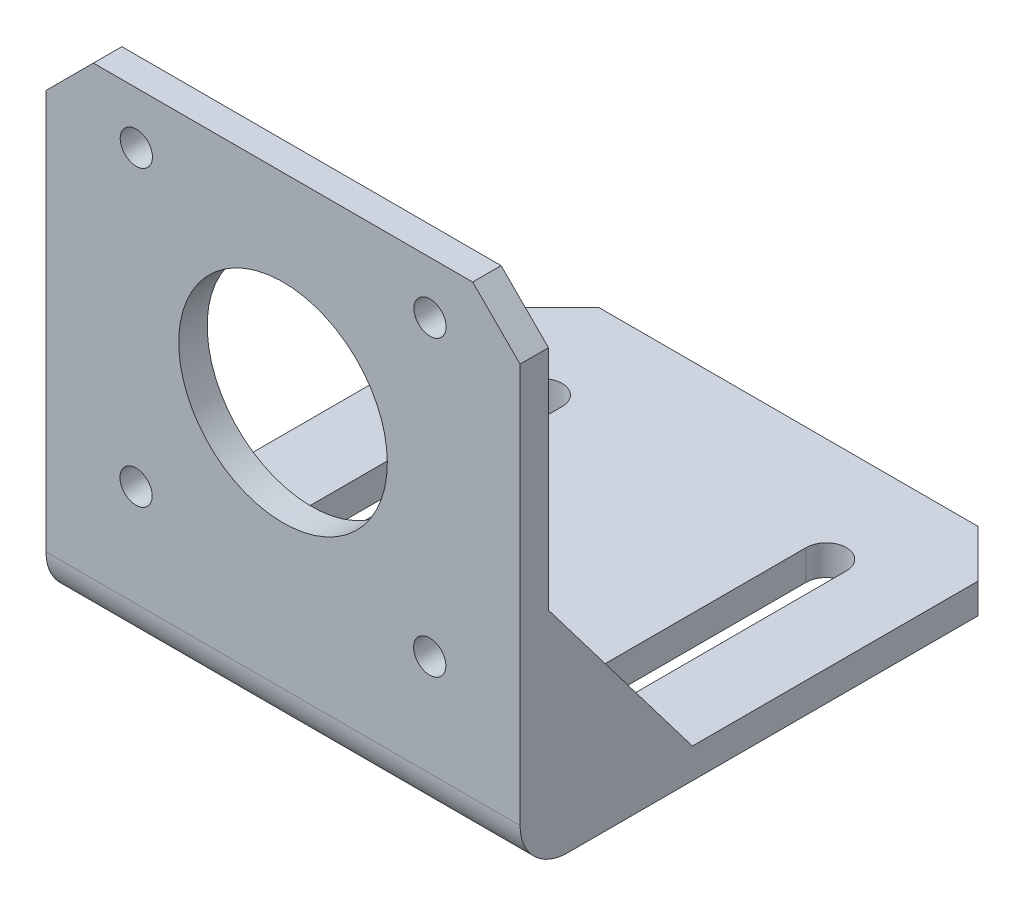
ISO-10303-21;
HEADER;
FILE_DESCRIPTION(('STEP AP214'),'2;1');
FILE_NAME('part.step','',(''),(''),'','','');
FILE_SCHEMA(('AUTOMOTIVE_DESIGN { 1 0 10303 214 1 1 1 1 }'));
ENDSEC;
DATA;
#1=APPLICATION_CONTEXT('core data for automotive mechanical design processes');
#2=APPLICATION_PROTOCOL_DEFINITION('international standard','automotive_design',2000,#1);
#3=PRODUCT_CONTEXT('',#1,'mechanical');
#4=PRODUCT('Part','Part','',(#3));
#5=PRODUCT_RELATED_PRODUCT_CATEGORY('part','',(#4));
#6=PRODUCT_DEFINITION_FORMATION('','',#4);
#7=PRODUCT_DEFINITION_CONTEXT('part definition',#1,'design');
#8=PRODUCT_DEFINITION('design','',#6,#7);
#9=PRODUCT_DEFINITION_SHAPE('','',#8);
#10=(LENGTH_UNIT() NAMED_UNIT(*) SI_UNIT(.MILLI.,.METRE.));
#11=(NAMED_UNIT(*) PLANE_ANGLE_UNIT() SI_UNIT($,.RADIAN.));
#12=(NAMED_UNIT(*) SI_UNIT($,.STERADIAN.) SOLID_ANGLE_UNIT());
#13=UNCERTAINTY_MEASURE_WITH_UNIT(LENGTH_MEASURE(1.E-05),#10,'distance_accuracy_value','');
#14=(GEOMETRIC_REPRESENTATION_CONTEXT(3) GLOBAL_UNCERTAINTY_ASSIGNED_CONTEXT((#13)) GLOBAL_UNIT_ASSIGNED_CONTEXT((#10,
#11,#12)) REPRESENTATION_CONTEXT('',''));
#15=CARTESIAN_POINT('',(0.,0.,0.));
#16=DIRECTION('',(0.,0.,1.));
#17=DIRECTION('',(1.,0.,0.));
#18=AXIS2_PLACEMENT_3D('',#15,#16,#17);
#19=CARTESIAN_POINT('',(0.,3.175,0.));
#20=DIRECTION('',(0.,-1.,0.));
#21=DIRECTION('',(0.,0.,-1.));
#22=AXIS2_PLACEMENT_3D('',#19,#20,#21);
#23=PLANE('',#22);
#24=DIRECTION('',(0.,0.,-1.));
#25=VECTOR('',#24,1.);
#26=CARTESIAN_POINT('',(3.175,3.175,-3.));
#27=LINE('',#26,#25);
#28=CARTESIAN_POINT('',(3.175,3.175,-8.));
#29=VERTEX_POINT('',#28);
#30=CARTESIAN_POINT('',(3.175,3.175,-18.));
#31=VERTEX_POINT('',#30);
#32=EDGE_CURVE('E307',#29,#31,#27,.T.);
#33=ORIENTED_EDGE('',*,*,#32,.F.);
#34=DIRECTION('',(-1.,0.,0.));
#35=VECTOR('',#34,1.);
#36=CARTESIAN_POINT('',(46.825,3.175,-8.));
#37=LINE('',#36,#35);
#38=CARTESIAN_POINT('',(46.825,3.175,-8.));
#39=VERTEX_POINT('',#38);
#40=EDGE_CURVE('E462',#29,#39,#37,.F.);
#41=ORIENTED_EDGE('',*,*,#40,.T.);
#42=DIRECTION('',(0.,0.,1.));
#43=VECTOR('',#42,1.);
#44=CARTESIAN_POINT('',(46.825,3.175,-3.));
#45=LINE('',#44,#43);
#46=CARTESIAN_POINT('',(46.825,3.175,-18.175));
#47=VERTEX_POINT('',#46);
#48=EDGE_CURVE('E301',#47,#39,#45,.T.);
#49=ORIENTED_EDGE('',*,*,#48,.F.);
#50=DIRECTION('',(-1.,0.,0.));
#51=VECTOR('',#50,1.);
#52=CARTESIAN_POINT('',(50.,3.175,-18.175));
#53=LINE('',#52,#51);
#54=CARTESIAN_POINT('',(50.,3.175,-18.175));
#55=VERTEX_POINT('',#54);
#56=EDGE_CURVE('E296',#55,#47,#53,.T.);
#57=ORIENTED_EDGE('',*,*,#56,.F.);
#58=DIRECTION('',(0.,0.,-1.));
#59=VECTOR('',#58,1.);
#60=CARTESIAN_POINT('',(50.,3.175,0.));
#61=LINE('',#60,#59);
#62=CARTESIAN_POINT('',(50.,3.175,-48.3));
#63=VERTEX_POINT('',#62);
#64=EDGE_CURVE('E338',#55,#63,#61,.T.);
#65=ORIENTED_EDGE('',*,*,#64,.T.);
#66=DIRECTION('',(0.707106781186546,0.,0.707106781186549));
#67=VECTOR('',#66,1.);
#68=CARTESIAN_POINT('',(45.,3.175,-53.3));
#69=LINE('',#68,#67);
#70=CARTESIAN_POINT('',(45.,3.175,-53.3));
#71=VERTEX_POINT('',#70);
#72=EDGE_CURVE('E358',#63,#71,#69,.F.);
#73=ORIENTED_EDGE('',*,*,#72,.T.);
#74=DIRECTION('',(-1.,0.,0.));
#75=VECTOR('',#74,1.);
#76=CARTESIAN_POINT('',(0.,3.175,-53.3));
#77=LINE('',#76,#75);
#78=CARTESIAN_POINT('',(5.00000000000002,3.175,-53.3));
#79=VERTEX_POINT('',#78);
#80=EDGE_CURVE('E374',#71,#79,#77,.T.);
#81=ORIENTED_EDGE('',*,*,#80,.T.);
#82=DIRECTION('',(0.70710678118655,0.,-0.707106781186546));
#83=VECTOR('',#82,1.);
#84=CARTESIAN_POINT('',(0.,3.175,-48.3));
#85=LINE('',#84,#83);
#86=CARTESIAN_POINT('',(0.,3.175,-48.3));
#87=VERTEX_POINT('',#86);
#88=EDGE_CURVE('E360',#79,#87,#85,.F.);
#89=ORIENTED_EDGE('',*,*,#88,.T.);
#90=DIRECTION('',(0.,0.,1.));
#91=VECTOR('',#90,1.);
#92=CARTESIAN_POINT('',(0.,3.175,0.));
#93=LINE('',#92,#91);
#94=CARTESIAN_POINT('',(0.,3.175,-18.));
#95=VERTEX_POINT('',#94);
#96=EDGE_CURVE('E335',#87,#95,#93,.T.);
#97=ORIENTED_EDGE('',*,*,#96,.T.);
#98=DIRECTION('',(-1.,0.,0.));
#99=VECTOR('',#98,1.);
#100=CARTESIAN_POINT('',(0.,3.175,-18.));
#101=LINE('',#100,#99);
#102=EDGE_CURVE('E311',#31,#95,#101,.T.);
#103=ORIENTED_EDGE('',*,*,#102,.F.);
#104=EDGE_LOOP('',(#33,#41,#49,#57,#65,#73,#81,#89,#97,#103));
#105=FACE_BOUND('',#104,.T.);
#106=CARTESIAN_POINT('',(10.,3.175,-12.3));
#107=DIRECTION('',(0.,1.,0.));
#108=DIRECTION('',(0.,0.,1.));
#109=AXIS2_PLACEMENT_3D('',#106,#107,#108);
#110=CIRCLE('',#109,2.125);
#111=CARTESIAN_POINT('',(7.87500000000001,3.175,-12.3));
#112=VERTEX_POINT('',#111);
#113=CARTESIAN_POINT('',(12.125,3.175,-12.3));
#114=VERTEX_POINT('',#113);
#115=EDGE_CURVE('E234',#112,#114,#110,.T.);
#116=ORIENTED_EDGE('',*,*,#115,.F.);
#117=DIRECTION('',(0.,0.,1.));
#118=VECTOR('',#117,1.);
#119=CARTESIAN_POINT('',(7.87500000000001,3.175,0.));
#120=LINE('',#119,#118);
#121=CARTESIAN_POINT('',(7.875,3.175,-42.3));
#122=VERTEX_POINT('',#121);
#123=EDGE_CURVE('E230',#122,#112,#120,.T.);
#124=ORIENTED_EDGE('',*,*,#123,.F.);
#125=CARTESIAN_POINT('',(10.,3.175,-42.3));
#126=DIRECTION('',(0.,1.,0.));
#127=DIRECTION('',(0.,0.,1.));
#128=AXIS2_PLACEMENT_3D('',#125,#126,#127);
#129=CIRCLE('',#128,2.125);
#130=CARTESIAN_POINT('',(12.125,3.175,-42.3));
#131=VERTEX_POINT('',#130);
#132=EDGE_CURVE('E240',#131,#122,#129,.T.);
#133=ORIENTED_EDGE('',*,*,#132,.F.);
#134=DIRECTION('',(0.,0.,1.));
#135=VECTOR('',#134,1.);
#136=CARTESIAN_POINT('',(12.125,3.175,0.));
#137=LINE('',#136,#135);
#138=EDGE_CURVE('E237',#131,#114,#137,.T.);
#139=ORIENTED_EDGE('',*,*,#138,.T.);
#140=EDGE_LOOP('',(#116,#124,#133,#139));
#141=FACE_BOUND('',#140,.T.);
#142=DIRECTION('',(0.,0.,1.));
#143=VECTOR('',#142,1.);
#144=CARTESIAN_POINT('',(42.125,3.175,0.));
#145=LINE('',#144,#143);
#146=CARTESIAN_POINT('',(42.125,3.175,-42.3));
#147=VERTEX_POINT('',#146);
#148=CARTESIAN_POINT('',(42.125,3.175,-12.3));
#149=VERTEX_POINT('',#148);
#150=EDGE_CURVE('E220',#147,#149,#145,.T.);
#151=ORIENTED_EDGE('',*,*,#150,.T.);
#152=CARTESIAN_POINT('',(40.,3.175,-12.3));
#153=DIRECTION('',(0.,1.,0.));
#154=DIRECTION('',(0.,0.,1.));
#155=AXIS2_PLACEMENT_3D('',#152,#153,#154);
#156=CIRCLE('',#155,2.12500000000001);
#157=CARTESIAN_POINT('',(37.875,3.175,-12.3));
#158=VERTEX_POINT('',#157);
#159=EDGE_CURVE('E223',#158,#149,#156,.T.);
#160=ORIENTED_EDGE('',*,*,#159,.F.);
#161=DIRECTION('',(0.,0.,1.));
#162=VECTOR('',#161,1.);
#163=CARTESIAN_POINT('',(37.875,3.175,0.));
#164=LINE('',#163,#162);
#165=CARTESIAN_POINT('',(37.875,3.175,-42.3));
#166=VERTEX_POINT('',#165);
#167=EDGE_CURVE('E204',#166,#158,#164,.T.);
#168=ORIENTED_EDGE('',*,*,#167,.F.);
#169=CARTESIAN_POINT('',(40.,3.175,-42.3));
#170=DIRECTION('',(0.,1.,0.));
#171=DIRECTION('',(0.,0.,1.));
#172=AXIS2_PLACEMENT_3D('',#169,#170,#171);
#173=CIRCLE('',#172,2.12500000000001);
#174=EDGE_CURVE('E215',#147,#166,#173,.T.);
#175=ORIENTED_EDGE('',*,*,#174,.F.);
#176=EDGE_LOOP('',(#151,#160,#168,#175));
#177=FACE_BOUND('',#176,.T.);
#178=ADVANCED_FACE('F33',(#105,#141,#177),#23,.F.);
#179=CARTESIAN_POINT('',(0.,0.,0.));
#180=DIRECTION('',(0.,-1.,0.));
#181=DIRECTION('',(0.,0.,-1.));
#182=AXIS2_PLACEMENT_3D('',#179,#180,#181);
#183=PLANE('',#182);
#184=DIRECTION('',(0.,0.,-1.));
#185=VECTOR('',#184,1.);
#186=CARTESIAN_POINT('',(50.,0.,0.));
#187=LINE('',#186,#185);
#188=CARTESIAN_POINT('',(50.,0.,-5.));
#189=VERTEX_POINT('',#188);
#190=CARTESIAN_POINT('',(50.,0.,-48.3));
#191=VERTEX_POINT('',#190);
#192=EDGE_CURVE('E518',#189,#191,#187,.T.);
#193=ORIENTED_EDGE('',*,*,#192,.F.);
#194=DIRECTION('',(1.,0.,0.));
#195=VECTOR('',#194,1.);
#196=CARTESIAN_POINT('',(0.,0.,-5.));
#197=LINE('',#196,#195);
#198=CARTESIAN_POINT('',(0.,0.,-5.));
#199=VERTEX_POINT('',#198);
#200=EDGE_CURVE('E41',#189,#199,#197,.F.);
#201=ORIENTED_EDGE('',*,*,#200,.T.);
#202=DIRECTION('',(0.,0.,1.));
#203=VECTOR('',#202,1.);
#204=CARTESIAN_POINT('',(0.,0.,0.));
#205=LINE('',#204,#203);
#206=CARTESIAN_POINT('',(0.,0.,-48.3));
#207=VERTEX_POINT('',#206);
#208=EDGE_CURVE('E366',#207,#199,#205,.T.);
#209=ORIENTED_EDGE('',*,*,#208,.F.);
#210=DIRECTION('',(-0.70710678118655,0.,0.707106781186546));
#211=VECTOR('',#210,1.);
#212=CARTESIAN_POINT('',(-24.15,0.,-24.1500000000001));
#213=LINE('',#212,#211);
#214=CARTESIAN_POINT('',(5.00000000000002,0.,-53.3));
#215=VERTEX_POINT('',#214);
#216=EDGE_CURVE('E351',#207,#215,#213,.F.);
#217=ORIENTED_EDGE('',*,*,#216,.T.);
#218=DIRECTION('',(-1.,0.,0.));
#219=VECTOR('',#218,1.);
#220=CARTESIAN_POINT('',(0.,0.,-53.3));
#221=LINE('',#220,#219);
#222=CARTESIAN_POINT('',(45.,0.,-53.3));
#223=VERTEX_POINT('',#222);
#224=EDGE_CURVE('E339',#223,#215,#221,.T.);
#225=ORIENTED_EDGE('',*,*,#224,.F.);
#226=DIRECTION('',(-0.707106781186546,0.,-0.707106781186549));
#227=VECTOR('',#226,1.);
#228=CARTESIAN_POINT('',(49.1500000000001,0.,-49.1499999999999));
#229=LINE('',#228,#227);
#230=EDGE_CURVE('E348',#223,#191,#229,.F.);
#231=ORIENTED_EDGE('',*,*,#230,.T.);
#232=EDGE_LOOP('',(#193,#201,#209,#217,#225,#231));
#233=FACE_BOUND('',#232,.T.);
#234=DIRECTION('',(0.,0.,-1.));
#235=VECTOR('',#234,1.);
#236=CARTESIAN_POINT('',(7.87500000000001,0.,0.));
#237=LINE('',#236,#235);
#238=CARTESIAN_POINT('',(7.87500000000001,0.,-12.3));
#239=VERTEX_POINT('',#238);
#240=CARTESIAN_POINT('',(7.875,0.,-42.3));
#241=VERTEX_POINT('',#240);
#242=EDGE_CURVE('E383',#239,#241,#237,.T.);
#243=ORIENTED_EDGE('',*,*,#242,.F.);
#244=CARTESIAN_POINT('',(10.,0.,-12.3));
#245=DIRECTION('',(0.,-1.,0.));
#246=DIRECTION('',(0.,0.,-1.));
#247=AXIS2_PLACEMENT_3D('',#244,#245,#246);
#248=CIRCLE('',#247,2.125);
#249=CARTESIAN_POINT('',(12.125,0.,-12.3));
#250=VERTEX_POINT('',#249);
#251=EDGE_CURVE('E375',#250,#239,#248,.T.);
#252=ORIENTED_EDGE('',*,*,#251,.F.);
#253=DIRECTION('',(0.,0.,-1.));
#254=VECTOR('',#253,1.);
#255=CARTESIAN_POINT('',(12.125,0.,0.));
#256=LINE('',#255,#254);
#257=CARTESIAN_POINT('',(12.125,0.,-42.3));
#258=VERTEX_POINT('',#257);
#259=EDGE_CURVE('E377',#250,#258,#256,.T.);
#260=ORIENTED_EDGE('',*,*,#259,.T.);
#261=CARTESIAN_POINT('',(10.,0.,-42.3));
#262=DIRECTION('',(0.,-1.,0.));
#263=DIRECTION('',(0.,0.,-1.));
#264=AXIS2_PLACEMENT_3D('',#261,#262,#263);
#265=CIRCLE('',#264,2.125);
#266=EDGE_CURVE('E381',#241,#258,#265,.T.);
#267=ORIENTED_EDGE('',*,*,#266,.F.);
#268=EDGE_LOOP('',(#243,#252,#260,#267));
#269=FACE_BOUND('',#268,.T.);
#270=CARTESIAN_POINT('',(40.,0.,-12.3));
#271=DIRECTION('',(0.,-1.,0.));
#272=DIRECTION('',(0.,0.,-1.));
#273=AXIS2_PLACEMENT_3D('',#270,#271,#272);
#274=CIRCLE('',#273,2.12500000000001);
#275=CARTESIAN_POINT('',(42.125,0.,-12.3));
#276=VERTEX_POINT('',#275);
#277=CARTESIAN_POINT('',(37.875,0.,-12.3));
#278=VERTEX_POINT('',#277);
#279=EDGE_CURVE('E388',#276,#278,#274,.T.);
#280=ORIENTED_EDGE('',*,*,#279,.F.);
#281=DIRECTION('',(0.,0.,-1.));
#282=VECTOR('',#281,1.);
#283=CARTESIAN_POINT('',(42.125,0.,0.));
#284=LINE('',#283,#282);
#285=CARTESIAN_POINT('',(42.125,0.,-42.3));
#286=VERTEX_POINT('',#285);
#287=EDGE_CURVE('E345',#276,#286,#284,.T.);
#288=ORIENTED_EDGE('',*,*,#287,.T.);
#289=CARTESIAN_POINT('',(40.,0.,-42.3));
#290=DIRECTION('',(0.,-1.,0.));
#291=DIRECTION('',(0.,0.,-1.));
#292=AXIS2_PLACEMENT_3D('',#289,#290,#291);
#293=CIRCLE('',#292,2.12500000000001);
#294=CARTESIAN_POINT('',(37.875,0.,-42.3));
#295=VERTEX_POINT('',#294);
#296=EDGE_CURVE('E385',#295,#286,#293,.T.);
#297=ORIENTED_EDGE('',*,*,#296,.F.);
#298=DIRECTION('',(0.,0.,-1.));
#299=VECTOR('',#298,1.);
#300=CARTESIAN_POINT('',(37.875,0.,0.));
#301=LINE('',#300,#299);
#302=EDGE_CURVE('E207',#278,#295,#301,.T.);
#303=ORIENTED_EDGE('',*,*,#302,.F.);
#304=EDGE_LOOP('',(#280,#288,#297,#303));
#305=FACE_BOUND('',#304,.T.);
#306=ADVANCED_FACE('F392',(#233,#269,#305),#183,.T.);
#307=CARTESIAN_POINT('',(0.,52.145,-3.));
#308=DIRECTION('',(0.,0.,1.));
#309=DIRECTION('',(1.,0.,0.));
#310=AXIS2_PLACEMENT_3D('',#307,#308,#309);
#311=PLANE('',#310);
#312=CARTESIAN_POINT('',(40.4720000000004,15.673,-3.));
#313=DIRECTION('',(0.,0.,1.));
#314=DIRECTION('',(1.,0.,0.));
#315=AXIS2_PLACEMENT_3D('',#312,#313,#314);
#316=CIRCLE('',#315,1.7);
#317=CARTESIAN_POINT('',(42.1720000000004,15.673,-3.));
#318=VERTEX_POINT('',#317);
#319=EDGE_CURVE('E255',#318,#318,#316,.T.);
#320=ORIENTED_EDGE('',*,*,#319,.T.);
#321=EDGE_LOOP('',(#320));
#322=FACE_BOUND('',#321,.T.);
#323=CARTESIAN_POINT('',(9.49800000000044,15.7029999999996,-3.));
#324=DIRECTION('',(0.,0.,1.));
#325=DIRECTION('',(1.,0.,0.));
#326=AXIS2_PLACEMENT_3D('',#323,#324,#325);
#327=CIRCLE('',#326,1.7);
#328=CARTESIAN_POINT('',(11.1980000000004,15.7029999999996,-3.));
#329=VERTEX_POINT('',#328);
#330=EDGE_CURVE('E261',#329,#329,#327,.T.);
#331=ORIENTED_EDGE('',*,*,#330,.T.);
#332=EDGE_LOOP('',(#331));
#333=FACE_BOUND('',#332,.T.);
#334=CARTESIAN_POINT('',(9.52800000000001,46.6769999999996,-3.));
#335=DIRECTION('',(0.,0.,1.));
#336=DIRECTION('',(1.,0.,0.));
#337=AXIS2_PLACEMENT_3D('',#334,#335,#336);
#338=CIRCLE('',#337,1.7);
#339=CARTESIAN_POINT('',(11.228,46.6769999999996,-3.));
#340=VERTEX_POINT('',#339);
#341=EDGE_CURVE('E267',#340,#340,#338,.T.);
#342=ORIENTED_EDGE('',*,*,#341,.T.);
#343=EDGE_LOOP('',(#342));
#344=FACE_BOUND('',#343,.T.);
#345=CARTESIAN_POINT('',(40.502,46.647,-3.));
#346=DIRECTION('',(0.,0.,1.));
#347=DIRECTION('',(1.,0.,0.));
#348=AXIS2_PLACEMENT_3D('',#345,#346,#347);
#349=CIRCLE('',#348,1.7);
#350=CARTESIAN_POINT('',(42.202,46.647,-3.));
#351=VERTEX_POINT('',#350);
#352=EDGE_CURVE('E273',#351,#351,#349,.T.);
#353=ORIENTED_EDGE('',*,*,#352,.T.);
#354=EDGE_LOOP('',(#353));
#355=FACE_BOUND('',#354,.T.);
#356=CARTESIAN_POINT('',(25.,31.145,-3.));
#357=DIRECTION('',(0.,0.,1.));
#358=DIRECTION('',(1.,0.,0.));
#359=AXIS2_PLACEMENT_3D('',#356,#357,#358);
#360=CIRCLE('',#359,11.);
#361=CARTESIAN_POINT('',(36.,31.145,-3.));
#362=VERTEX_POINT('',#361);
#363=EDGE_CURVE('E279',#362,#362,#360,.T.);
#364=ORIENTED_EDGE('',*,*,#363,.T.);
#365=EDGE_LOOP('',(#364));
#366=FACE_BOUND('',#365,.T.);
#367=DIRECTION('',(0.,-1.,0.));
#368=VECTOR('',#367,1.);
#369=CARTESIAN_POINT('',(46.825,23.175,-3.));
#370=LINE('',#369,#368);
#371=CARTESIAN_POINT('',(46.825,23.175,-3.));
#372=VERTEX_POINT('',#371);
#373=CARTESIAN_POINT('',(46.825,8.175,-3.));
#374=VERTEX_POINT('',#373);
#375=EDGE_CURVE('E300',#372,#374,#370,.T.);
#376=ORIENTED_EDGE('',*,*,#375,.T.);
#377=DIRECTION('',(-1.,0.,0.));
#378=VECTOR('',#377,1.);
#379=CARTESIAN_POINT('',(3.175,8.175,-3.));
#380=LINE('',#379,#378);
#381=CARTESIAN_POINT('',(3.175,8.175,-3.));
#382=VERTEX_POINT('',#381);
#383=EDGE_CURVE('E464',#374,#382,#380,.T.);
#384=ORIENTED_EDGE('',*,*,#383,.T.);
#385=DIRECTION('',(0.,-1.,0.));
#386=VECTOR('',#385,1.);
#387=CARTESIAN_POINT('',(3.175,23.175,-3.));
#388=LINE('',#387,#386);
#389=CARTESIAN_POINT('',(3.175,23.175,-3.));
#390=VERTEX_POINT('',#389);
#391=EDGE_CURVE('E320',#390,#382,#388,.T.);
#392=ORIENTED_EDGE('',*,*,#391,.F.);
#393=DIRECTION('',(1.,0.,0.));
#394=VECTOR('',#393,1.);
#395=CARTESIAN_POINT('',(0.,23.175,-3.));
#396=LINE('',#395,#394);
#397=CARTESIAN_POINT('',(0.,23.175,-3.));
#398=VERTEX_POINT('',#397);
#399=EDGE_CURVE('E308',#398,#390,#396,.T.);
#400=ORIENTED_EDGE('',*,*,#399,.F.);
#401=DIRECTION('',(0.,-1.,0.));
#402=VECTOR('',#401,1.);
#403=CARTESIAN_POINT('',(0.,52.145,-3.));
#404=LINE('',#403,#402);
#405=CARTESIAN_POINT('',(0.,47.145,-3.));
#406=VERTEX_POINT('',#405);
#407=EDGE_CURVE('E329',#406,#398,#404,.T.);
#408=ORIENTED_EDGE('',*,*,#407,.F.);
#409=DIRECTION('',(-0.707106781186547,-0.707106781186549,0.));
#410=VECTOR('',#409,1.);
#411=CARTESIAN_POINT('',(5.,52.145,-3.));
#412=LINE('',#411,#410);
#413=CARTESIAN_POINT('',(5.,52.145,-3.));
#414=VERTEX_POINT('',#413);
#415=EDGE_CURVE('E477',#406,#414,#412,.F.);
#416=ORIENTED_EDGE('',*,*,#415,.T.);
#417=DIRECTION('',(-1.,0.,0.));
#418=VECTOR('',#417,1.);
#419=CARTESIAN_POINT('',(0.,52.145,-3.));
#420=LINE('',#419,#418);
#421=CARTESIAN_POINT('',(45.,52.145,-3.));
#422=VERTEX_POINT('',#421);
#423=EDGE_CURVE('E326',#422,#414,#420,.T.);
#424=ORIENTED_EDGE('',*,*,#423,.F.);
#425=DIRECTION('',(-0.707106781186546,0.707106781186549,0.));
#426=VECTOR('',#425,1.);
#427=CARTESIAN_POINT('',(45.,52.145,-3.));
#428=LINE('',#427,#426);
#429=CARTESIAN_POINT('',(50.,47.145,-3.));
#430=VERTEX_POINT('',#429);
#431=EDGE_CURVE('E479',#422,#430,#428,.F.);
#432=ORIENTED_EDGE('',*,*,#431,.T.);
#433=DIRECTION('',(0.,-1.,0.));
#434=VECTOR('',#433,1.);
#435=CARTESIAN_POINT('',(50.,52.145,-3.));
#436=LINE('',#435,#434);
#437=CARTESIAN_POINT('',(50.,23.175,-3.));
#438=VERTEX_POINT('',#437);
#439=EDGE_CURVE('E363',#430,#438,#436,.T.);
#440=ORIENTED_EDGE('',*,*,#439,.T.);
#441=DIRECTION('',(1.,0.,0.));
#442=VECTOR('',#441,1.);
#443=CARTESIAN_POINT('',(50.,23.175,-3.));
#444=LINE('',#443,#442);
#445=EDGE_CURVE('E297',#372,#438,#444,.T.);
#446=ORIENTED_EDGE('',*,*,#445,.F.);
#447=EDGE_LOOP('',(#376,#384,#392,#400,#408,#416,#424,#432,#440,#446));
#448=FACE_BOUND('',#447,.T.);
#449=ADVANCED_FACE('F413',(#322,#333,#344,#355,#366,#448),#311,.F.);
#450=CARTESIAN_POINT('',(0.,3.175,0.));
#451=DIRECTION('',(1.,0.,0.));
#452=DIRECTION('',(0.,0.,-1.));
#453=AXIS2_PLACEMENT_3D('',#450,#451,#452);
#454=PLANE('',#453);
#455=ORIENTED_EDGE('',*,*,#208,.T.);
#456=CARTESIAN_POINT('',(0.,5.,-5.));
#457=DIRECTION('',(1.,0.,0.));
#458=DIRECTION('',(0.,0.,-1.));
#459=AXIS2_PLACEMENT_3D('',#456,#457,#458);
#460=CIRCLE('',#459,5.);
#461=CARTESIAN_POINT('',(0.,5.,0.));
#462=VERTEX_POINT('',#461);
#463=EDGE_CURVE('E11',#199,#462,#460,.F.);
#464=ORIENTED_EDGE('',*,*,#463,.T.);
#465=DIRECTION('',(0.,-1.,0.));
#466=VECTOR('',#465,1.);
#467=CARTESIAN_POINT('',(0.,3.175,0.));
#468=LINE('',#467,#466);
#469=CARTESIAN_POINT('',(0.,47.145,0.));
#470=VERTEX_POINT('',#469);
#471=EDGE_CURVE('E378',#470,#462,#468,.T.);
#472=ORIENTED_EDGE('',*,*,#471,.F.);
#473=DIRECTION('',(0.,0.,-1.));
#474=VECTOR('',#473,1.);
#475=CARTESIAN_POINT('',(0.,47.145,0.));
#476=LINE('',#475,#474);
#477=EDGE_CURVE('E342',#470,#406,#476,.T.);
#478=ORIENTED_EDGE('',*,*,#477,.T.);
#479=ORIENTED_EDGE('',*,*,#407,.T.);
#480=DIRECTION('',(0.,-0.796641666002382,-0.604451864079307));
#481=VECTOR('',#480,1.);
#482=CARTESIAN_POINT('',(0.,11.9268357398341,-11.5345446324008));
#483=LINE('',#482,#481);
#484=CARTESIAN_POINT('',(0.,3.40564250411862,-18.));
#485=VERTEX_POINT('',#484);
#486=EDGE_CURVE('E293',#398,#485,#483,.T.);
#487=ORIENTED_EDGE('',*,*,#486,.T.);
#488=DIRECTION('',(0.,-1.,0.));
#489=VECTOR('',#488,1.);
#490=CARTESIAN_POINT('',(0.,23.175,-18.));
#491=LINE('',#490,#489);
#492=EDGE_CURVE('E310',#485,#95,#491,.T.);
#493=ORIENTED_EDGE('',*,*,#492,.T.);
#494=ORIENTED_EDGE('',*,*,#96,.F.);
#495=DIRECTION('',(0.,-1.,0.));
#496=VECTOR('',#495,1.);
#497=CARTESIAN_POINT('',(0.,3.175,-48.3));
#498=LINE('',#497,#496);
#499=EDGE_CURVE('E344',#87,#207,#498,.T.);
#500=ORIENTED_EDGE('',*,*,#499,.T.);
#501=EDGE_LOOP('',(#455,#464,#472,#478,#479,#487,#493,#494,#500));
#502=FACE_BOUND('',#501,.T.);
#503=ADVANCED_FACE('F431',(#502),#454,.F.);
#504=CARTESIAN_POINT('',(0.,3.175,0.));
#505=DIRECTION('',(0.,0.,-1.));
#506=DIRECTION('',(-1.,0.,0.));
#507=AXIS2_PLACEMENT_3D('',#504,#505,#506);
#508=PLANE('',#507);
#509=CARTESIAN_POINT('',(40.4720000000004,15.673,0.));
#510=DIRECTION('',(0.,0.,1.));
#511=DIRECTION('',(1.,0.,0.));
#512=AXIS2_PLACEMENT_3D('',#509,#510,#511);
#513=CIRCLE('',#512,1.7);
#514=CARTESIAN_POINT('',(42.1720000000004,15.673,0.));
#515=VERTEX_POINT('',#514);
#516=EDGE_CURVE('E246',#515,#515,#513,.T.);
#517=ORIENTED_EDGE('',*,*,#516,.F.);
#518=EDGE_LOOP('',(#517));
#519=FACE_BOUND('',#518,.T.);
#520=CARTESIAN_POINT('',(9.49800000000044,15.7029999999996,0.));
#521=DIRECTION('',(0.,0.,1.));
#522=DIRECTION('',(1.,0.,0.));
#523=AXIS2_PLACEMENT_3D('',#520,#521,#522);
#524=CIRCLE('',#523,1.7);
#525=CARTESIAN_POINT('',(11.1980000000004,15.7029999999996,0.));
#526=VERTEX_POINT('',#525);
#527=EDGE_CURVE('E258',#526,#526,#524,.T.);
#528=ORIENTED_EDGE('',*,*,#527,.F.);
#529=EDGE_LOOP('',(#528));
#530=FACE_BOUND('',#529,.T.);
#531=CARTESIAN_POINT('',(9.52800000000001,46.6769999999996,0.));
#532=DIRECTION('',(0.,0.,1.));
#533=DIRECTION('',(1.,0.,0.));
#534=AXIS2_PLACEMENT_3D('',#531,#532,#533);
#535=CIRCLE('',#534,1.7);
#536=CARTESIAN_POINT('',(11.228,46.6769999999996,0.));
#537=VERTEX_POINT('',#536);
#538=EDGE_CURVE('E264',#537,#537,#535,.T.);
#539=ORIENTED_EDGE('',*,*,#538,.F.);
#540=EDGE_LOOP('',(#539));
#541=FACE_BOUND('',#540,.T.);
#542=CARTESIAN_POINT('',(40.502,46.647,0.));
#543=DIRECTION('',(0.,0.,1.));
#544=DIRECTION('',(1.,0.,0.));
#545=AXIS2_PLACEMENT_3D('',#542,#543,#544);
#546=CIRCLE('',#545,1.7);
#547=CARTESIAN_POINT('',(42.202,46.647,0.));
#548=VERTEX_POINT('',#547);
#549=EDGE_CURVE('E270',#548,#548,#546,.T.);
#550=ORIENTED_EDGE('',*,*,#549,.F.);
#551=EDGE_LOOP('',(#550));
#552=FACE_BOUND('',#551,.T.);
#553=CARTESIAN_POINT('',(25.,31.145,0.));
#554=DIRECTION('',(0.,0.,1.));
#555=DIRECTION('',(1.,0.,0.));
#556=AXIS2_PLACEMENT_3D('',#553,#554,#555);
#557=CIRCLE('',#556,11.);
#558=CARTESIAN_POINT('',(36.,31.145,0.));
#559=VERTEX_POINT('',#558);
#560=EDGE_CURVE('E276',#559,#559,#557,.T.);
#561=ORIENTED_EDGE('',*,*,#560,.F.);
#562=EDGE_LOOP('',(#561));
#563=FACE_BOUND('',#562,.T.);
#564=ORIENTED_EDGE('',*,*,#471,.T.);
#565=DIRECTION('',(1.,0.,0.));
#566=VECTOR('',#565,1.);
#567=CARTESIAN_POINT('',(50.,5.,0.));
#568=LINE('',#567,#566);
#569=CARTESIAN_POINT('',(50.,5.,0.));
#570=VERTEX_POINT('',#569);
#571=EDGE_CURVE('E467',#462,#570,#568,.T.);
#572=ORIENTED_EDGE('',*,*,#571,.T.);
#573=DIRECTION('',(0.,-1.,0.));
#574=VECTOR('',#573,1.);
#575=CARTESIAN_POINT('',(50.,3.175,0.));
#576=LINE('',#575,#574);
#577=CARTESIAN_POINT('',(50.,47.145,0.));
#578=VERTEX_POINT('',#577);
#579=EDGE_CURVE('E496',#578,#570,#576,.T.);
#580=ORIENTED_EDGE('',*,*,#579,.F.);
#581=DIRECTION('',(0.707106781186546,-0.707106781186549,0.));
#582=VECTOR('',#581,1.);
#583=CARTESIAN_POINT('',(45.,52.145,0.));
#584=LINE('',#583,#582);
#585=CARTESIAN_POINT('',(45.,52.145,0.));
#586=VERTEX_POINT('',#585);
#587=EDGE_CURVE('E483',#578,#586,#584,.F.);
#588=ORIENTED_EDGE('',*,*,#587,.T.);
#589=DIRECTION('',(1.,0.,0.));
#590=VECTOR('',#589,1.);
#591=CARTESIAN_POINT('',(0.,52.145,0.));
#592=LINE('',#591,#590);
#593=CARTESIAN_POINT('',(5.,52.145,0.));
#594=VERTEX_POINT('',#593);
#595=EDGE_CURVE('E323',#594,#586,#592,.T.);
#596=ORIENTED_EDGE('',*,*,#595,.F.);
#597=DIRECTION('',(0.707106781186547,0.707106781186549,0.));
#598=VECTOR('',#597,1.);
#599=CARTESIAN_POINT('',(5.,52.145,0.));
#600=LINE('',#599,#598);
#601=EDGE_CURVE('E481',#594,#470,#600,.F.);
#602=ORIENTED_EDGE('',*,*,#601,.T.);
#603=EDGE_LOOP('',(#564,#572,#580,#588,#596,#602));
#604=FACE_BOUND('',#603,.T.);
#605=ADVANCED_FACE('F428',(#519,#530,#541,#552,#563,#604),#508,.F.);
#606=CARTESIAN_POINT('',(50.,3.175,0.));
#607=DIRECTION('',(-1.,0.,0.));
#608=DIRECTION('',(0.,0.,1.));
#609=AXIS2_PLACEMENT_3D('',#606,#607,#608);
#610=PLANE('',#609);
#611=ORIENTED_EDGE('',*,*,#579,.T.);
#612=CARTESIAN_POINT('',(50.,5.,-5.));
#613=DIRECTION('',(-1.,0.,0.));
#614=DIRECTION('',(0.,0.,1.));
#615=AXIS2_PLACEMENT_3D('',#612,#613,#614);
#616=CIRCLE('',#615,5.);
#617=EDGE_CURVE('E55',#570,#189,#616,.F.);
#618=ORIENTED_EDGE('',*,*,#617,.T.);
#619=ORIENTED_EDGE('',*,*,#192,.T.);
#620=DIRECTION('',(0.,1.,0.));
#621=VECTOR('',#620,1.);
#622=CARTESIAN_POINT('',(50.,3.175,-48.3));
#623=LINE('',#622,#621);
#624=EDGE_CURVE('E490',#191,#63,#623,.T.);
#625=ORIENTED_EDGE('',*,*,#624,.T.);
#626=ORIENTED_EDGE('',*,*,#64,.F.);
#627=DIRECTION('',(0.,-0.796641666002382,-0.604451864079307));
#628=VECTOR('',#627,1.);
#629=CARTESIAN_POINT('',(50.,3.175,-18.175));
#630=LINE('',#629,#628);
#631=EDGE_CURVE('E282',#438,#55,#630,.T.);
#632=ORIENTED_EDGE('',*,*,#631,.F.);
#633=ORIENTED_EDGE('',*,*,#439,.F.);
#634=DIRECTION('',(0.,0.,1.));
#635=VECTOR('',#634,1.);
#636=CARTESIAN_POINT('',(50.,47.145,0.));
#637=LINE('',#636,#635);
#638=EDGE_CURVE('E362',#430,#578,#637,.T.);
#639=ORIENTED_EDGE('',*,*,#638,.T.);
#640=EDGE_LOOP('',(#611,#618,#619,#625,#626,#632,#633,#639));
#641=FACE_BOUND('',#640,.T.);
#642=ADVANCED_FACE('F424',(#641),#610,.F.);
#643=CARTESIAN_POINT('',(0.,3.175,-53.3));
#644=DIRECTION('',(0.,0.,1.));
#645=DIRECTION('',(1.,0.,0.));
#646=AXIS2_PLACEMENT_3D('',#643,#644,#645);
#647=PLANE('',#646);
#648=ORIENTED_EDGE('',*,*,#224,.T.);
#649=DIRECTION('',(0.,1.,0.));
#650=VECTOR('',#649,1.);
#651=CARTESIAN_POINT('',(5.00000000000002,3.175,-53.3));
#652=LINE('',#651,#650);
#653=EDGE_CURVE('E356',#215,#79,#652,.T.);
#654=ORIENTED_EDGE('',*,*,#653,.T.);
#655=ORIENTED_EDGE('',*,*,#80,.F.);
#656=DIRECTION('',(0.,-1.,0.));
#657=VECTOR('',#656,1.);
#658=CARTESIAN_POINT('',(45.,3.175,-53.3));
#659=LINE('',#658,#657);
#660=EDGE_CURVE('E353',#71,#223,#659,.T.);
#661=ORIENTED_EDGE('',*,*,#660,.T.);
#662=EDGE_LOOP('',(#648,#654,#655,#661));
#663=FACE_BOUND('',#662,.T.);
#664=ADVANCED_FACE('F420',(#663),#647,.F.);
#665=CARTESIAN_POINT('',(0.,52.145,0.));
#666=DIRECTION('',(0.,-1.,0.));
#667=DIRECTION('',(0.,0.,-1.));
#668=AXIS2_PLACEMENT_3D('',#665,#666,#667);
#669=PLANE('',#668);
#670=ORIENTED_EDGE('',*,*,#423,.T.);
#671=DIRECTION('',(0.,0.,1.));
#672=VECTOR('',#671,1.);
#673=CARTESIAN_POINT('',(5.,52.145,0.));
#674=LINE('',#673,#672);
#675=EDGE_CURVE('E485',#414,#594,#674,.T.);
#676=ORIENTED_EDGE('',*,*,#675,.T.);
#677=ORIENTED_EDGE('',*,*,#595,.T.);
#678=DIRECTION('',(0.,0.,-1.));
#679=VECTOR('',#678,1.);
#680=CARTESIAN_POINT('',(45.,52.145,0.));
#681=LINE('',#680,#679);
#682=EDGE_CURVE('E488',#586,#422,#681,.T.);
#683=ORIENTED_EDGE('',*,*,#682,.T.);
#684=EDGE_LOOP('',(#670,#676,#677,#683));
#685=FACE_BOUND('',#684,.T.);
#686=ADVANCED_FACE('F423',(#685),#669,.F.);
#687=CARTESIAN_POINT('',(3.175,23.175,-3.));
#688=DIRECTION('',(-1.,0.,0.));
#689=DIRECTION('',(0.,0.,1.));
#690=AXIS2_PLACEMENT_3D('',#687,#688,#689);
#691=PLANE('',#690);
#692=ORIENTED_EDGE('',*,*,#391,.T.);
#693=CARTESIAN_POINT('',(3.175,8.175,-8.));
#694=DIRECTION('',(-1.,0.,0.));
#695=DIRECTION('',(0.,0.,1.));
#696=AXIS2_PLACEMENT_3D('',#693,#694,#695);
#697=CIRCLE('',#696,5.);
#698=EDGE_CURVE('E471',#382,#29,#697,.F.);
#699=ORIENTED_EDGE('',*,*,#698,.T.);
#700=ORIENTED_EDGE('',*,*,#32,.T.);
#701=DIRECTION('',(0.,-1.,0.));
#702=VECTOR('',#701,1.);
#703=CARTESIAN_POINT('',(3.175,23.175,-18.));
#704=LINE('',#703,#702);
#705=CARTESIAN_POINT('',(3.175,3.40564250411862,-18.));
#706=VERTEX_POINT('',#705);
#707=EDGE_CURVE('E317',#706,#31,#704,.T.);
#708=ORIENTED_EDGE('',*,*,#707,.F.);
#709=DIRECTION('',(0.,0.796641666002382,0.604451864079307));
#710=VECTOR('',#709,1.);
#711=CARTESIAN_POINT('',(3.175,23.175,-3.));
#712=LINE('',#711,#710);
#713=EDGE_CURVE('E290',#706,#390,#712,.T.);
#714=ORIENTED_EDGE('',*,*,#713,.T.);
#715=EDGE_LOOP('',(#692,#699,#700,#708,#714));
#716=FACE_BOUND('',#715,.T.);
#717=ADVANCED_FACE('F590',(#716),#691,.F.);
#718=CARTESIAN_POINT('',(0.,23.175,-18.));
#719=DIRECTION('',(0.,0.,1.));
#720=DIRECTION('',(1.,0.,0.));
#721=AXIS2_PLACEMENT_3D('',#718,#719,#720);
#722=PLANE('',#721);
#723=ORIENTED_EDGE('',*,*,#492,.F.);
#724=DIRECTION('',(1.,0.,0.));
#725=VECTOR('',#724,1.);
#726=CARTESIAN_POINT('',(0.,3.40564250411862,-18.));
#727=LINE('',#726,#725);
#728=EDGE_CURVE('E287',#485,#706,#727,.T.);
#729=ORIENTED_EDGE('',*,*,#728,.T.);
#730=ORIENTED_EDGE('',*,*,#707,.T.);
#731=ORIENTED_EDGE('',*,*,#102,.T.);
#732=EDGE_LOOP('',(#723,#729,#730,#731));
#733=FACE_BOUND('',#732,.T.);
#734=ADVANCED_FACE('F587',(#733),#722,.F.);
#735=CARTESIAN_POINT('',(46.825,23.175,-3.));
#736=DIRECTION('',(1.,0.,0.));
#737=DIRECTION('',(0.,0.,-1.));
#738=AXIS2_PLACEMENT_3D('',#735,#736,#737);
#739=PLANE('',#738);
#740=ORIENTED_EDGE('',*,*,#48,.T.);
#741=CARTESIAN_POINT('',(46.825,8.175,-8.));
#742=DIRECTION('',(1.,0.,0.));
#743=DIRECTION('',(0.,0.,-1.));
#744=AXIS2_PLACEMENT_3D('',#741,#742,#743);
#745=CIRCLE('',#744,5.);
#746=EDGE_CURVE('E461',#39,#374,#745,.F.);
#747=ORIENTED_EDGE('',*,*,#746,.T.);
#748=ORIENTED_EDGE('',*,*,#375,.F.);
#749=DIRECTION('',(0.,-0.796641666002382,-0.604451864079307));
#750=VECTOR('',#749,1.);
#751=CARTESIAN_POINT('',(46.825,23.175,-3.));
#752=LINE('',#751,#750);
#753=EDGE_CURVE('E284',#372,#47,#752,.T.);
#754=ORIENTED_EDGE('',*,*,#753,.T.);
#755=EDGE_LOOP('',(#740,#747,#748,#754));
#756=FACE_BOUND('',#755,.T.);
#757=ADVANCED_FACE('F584',(#756),#739,.F.);
#758=CARTESIAN_POINT('',(-15.,3.175,-18.175));
#759=DIRECTION('',(0.,-0.604451864079307,0.796641666002382));
#760=DIRECTION('',(0.,-0.796641666002382,-0.604451864079307));
#761=AXIS2_PLACEMENT_3D('',#758,#759,#760);
#762=PLANE('',#761);
#763=ORIENTED_EDGE('',*,*,#445,.T.);
#764=ORIENTED_EDGE('',*,*,#631,.T.);
#765=ORIENTED_EDGE('',*,*,#56,.T.);
#766=ORIENTED_EDGE('',*,*,#753,.F.);
#767=EDGE_LOOP('',(#763,#764,#765,#766));
#768=FACE_BOUND('',#767,.T.);
#769=ADVANCED_FACE('F582',(#768),#762,.F.);
#770=ORIENTED_EDGE('',*,*,#399,.T.);
#771=ORIENTED_EDGE('',*,*,#713,.F.);
#772=ORIENTED_EDGE('',*,*,#728,.F.);
#773=ORIENTED_EDGE('',*,*,#486,.F.);
#774=EDGE_LOOP('',(#770,#771,#772,#773));
#775=FACE_BOUND('',#774,.T.);
#776=ADVANCED_FACE('F578',(#775),#762,.F.);
#777=CARTESIAN_POINT('',(25.,31.145,-65.));
#778=DIRECTION('',(0.,0.,1.));
#779=DIRECTION('',(1.,0.,0.));
#780=AXIS2_PLACEMENT_3D('',#777,#778,#779);
#781=CYLINDRICAL_SURFACE('',#780,11.);
#782=ORIENTED_EDGE('',*,*,#560,.T.);
#783=EDGE_LOOP('',(#782));
#784=FACE_BOUND('',#783,.T.);
#785=ORIENTED_EDGE('',*,*,#363,.F.);
#786=EDGE_LOOP('',(#785));
#787=FACE_BOUND('',#786,.T.);
#788=ADVANCED_FACE('F574',(#784,#787),#781,.F.);
#789=CARTESIAN_POINT('',(40.502,46.647,-65.));
#790=DIRECTION('',(0.,0.,1.));
#791=DIRECTION('',(1.,0.,0.));
#792=AXIS2_PLACEMENT_3D('',#789,#790,#791);
#793=CYLINDRICAL_SURFACE('',#792,1.7);
#794=ORIENTED_EDGE('',*,*,#549,.T.);
#795=EDGE_LOOP('',(#794));
#796=FACE_BOUND('',#795,.T.);
#797=ORIENTED_EDGE('',*,*,#352,.F.);
#798=EDGE_LOOP('',(#797));
#799=FACE_BOUND('',#798,.T.);
#800=ADVANCED_FACE('F570',(#796,#799),#793,.F.);
#801=CARTESIAN_POINT('',(9.52800000000001,46.6769999999996,-65.));
#802=DIRECTION('',(0.,0.,1.));
#803=DIRECTION('',(1.,0.,0.));
#804=AXIS2_PLACEMENT_3D('',#801,#802,#803);
#805=CYLINDRICAL_SURFACE('',#804,1.7);
#806=ORIENTED_EDGE('',*,*,#538,.T.);
#807=EDGE_LOOP('',(#806));
#808=FACE_BOUND('',#807,.T.);
#809=ORIENTED_EDGE('',*,*,#341,.F.);
#810=EDGE_LOOP('',(#809));
#811=FACE_BOUND('',#810,.T.);
#812=ADVANCED_FACE('F566',(#808,#811),#805,.F.);
#813=CARTESIAN_POINT('',(9.49800000000044,15.7029999999996,-65.));
#814=DIRECTION('',(0.,0.,1.));
#815=DIRECTION('',(1.,0.,0.));
#816=AXIS2_PLACEMENT_3D('',#813,#814,#815);
#817=CYLINDRICAL_SURFACE('',#816,1.7);
#818=ORIENTED_EDGE('',*,*,#527,.T.);
#819=EDGE_LOOP('',(#818));
#820=FACE_BOUND('',#819,.T.);
#821=ORIENTED_EDGE('',*,*,#330,.F.);
#822=EDGE_LOOP('',(#821));
#823=FACE_BOUND('',#822,.T.);
#824=ADVANCED_FACE('F562',(#820,#823),#817,.F.);
#825=CARTESIAN_POINT('',(40.4720000000004,15.673,-65.));
#826=DIRECTION('',(0.,0.,1.));
#827=DIRECTION('',(1.,0.,0.));
#828=AXIS2_PLACEMENT_3D('',#825,#826,#827);
#829=CYLINDRICAL_SURFACE('',#828,1.7);
#830=ORIENTED_EDGE('',*,*,#516,.T.);
#831=EDGE_LOOP('',(#830));
#832=FACE_BOUND('',#831,.T.);
#833=ORIENTED_EDGE('',*,*,#319,.F.);
#834=EDGE_LOOP('',(#833));
#835=FACE_BOUND('',#834,.T.);
#836=ADVANCED_FACE('F559',(#832,#835),#829,.F.);
#837=CARTESIAN_POINT('',(7.87500000000001,-61.825,0.));
#838=DIRECTION('',(-1.,0.,0.));
#839=DIRECTION('',(0.,0.,1.));
#840=AXIS2_PLACEMENT_3D('',#837,#838,#839);
#841=PLANE('',#840);
#842=ORIENTED_EDGE('',*,*,#242,.T.);
#843=DIRECTION('',(0.,1.,0.));
#844=VECTOR('',#843,1.);
#845=CARTESIAN_POINT('',(7.875,-61.825,-42.3));
#846=LINE('',#845,#844);
#847=EDGE_CURVE('E244',#241,#122,#846,.T.);
#848=ORIENTED_EDGE('',*,*,#847,.T.);
#849=ORIENTED_EDGE('',*,*,#123,.T.);
#850=DIRECTION('',(0.,1.,0.));
#851=VECTOR('',#850,1.);
#852=CARTESIAN_POINT('',(7.87500000000001,-61.825,-12.3));
#853=LINE('',#852,#851);
#854=EDGE_CURVE('E243',#239,#112,#853,.T.);
#855=ORIENTED_EDGE('',*,*,#854,.F.);
#856=EDGE_LOOP('',(#842,#848,#849,#855));
#857=FACE_BOUND('',#856,.T.);
#858=ADVANCED_FACE('F536',(#857),#841,.F.);
#859=CARTESIAN_POINT('',(10.,-61.825,-42.3));
#860=DIRECTION('',(0.,1.,0.));
#861=DIRECTION('',(0.,0.,1.));
#862=AXIS2_PLACEMENT_3D('',#859,#860,#861);
#863=CYLINDRICAL_SURFACE('',#862,2.125);
#864=ORIENTED_EDGE('',*,*,#266,.T.);
#865=DIRECTION('',(0.,1.,0.));
#866=VECTOR('',#865,1.);
#867=CARTESIAN_POINT('',(12.125,-61.825,-42.3));
#868=LINE('',#867,#866);
#869=EDGE_CURVE('E247',#258,#131,#868,.T.);
#870=ORIENTED_EDGE('',*,*,#869,.T.);
#871=ORIENTED_EDGE('',*,*,#132,.T.);
#872=ORIENTED_EDGE('',*,*,#847,.F.);
#873=EDGE_LOOP('',(#864,#870,#871,#872));
#874=FACE_BOUND('',#873,.T.);
#875=ADVANCED_FACE('F538',(#874),#863,.F.);
#876=CARTESIAN_POINT('',(12.125,-61.825,0.));
#877=DIRECTION('',(-1.,0.,0.));
#878=DIRECTION('',(0.,0.,1.));
#879=AXIS2_PLACEMENT_3D('',#876,#877,#878);
#880=PLANE('',#879);
#881=DIRECTION('',(0.,1.,0.));
#882=VECTOR('',#881,1.);
#883=CARTESIAN_POINT('',(12.125,-61.825,-12.3));
#884=LINE('',#883,#882);
#885=EDGE_CURVE('E249',#250,#114,#884,.T.);
#886=ORIENTED_EDGE('',*,*,#885,.T.);
#887=ORIENTED_EDGE('',*,*,#138,.F.);
#888=ORIENTED_EDGE('',*,*,#869,.F.);
#889=ORIENTED_EDGE('',*,*,#259,.F.);
#890=EDGE_LOOP('',(#886,#887,#888,#889));
#891=FACE_BOUND('',#890,.T.);
#892=ADVANCED_FACE('F547',(#891),#880,.T.);
#893=CARTESIAN_POINT('',(10.,-61.825,-12.3));
#894=DIRECTION('',(0.,1.,0.));
#895=DIRECTION('',(0.,0.,1.));
#896=AXIS2_PLACEMENT_3D('',#893,#894,#895);
#897=CYLINDRICAL_SURFACE('',#896,2.125);
#898=ORIENTED_EDGE('',*,*,#251,.T.);
#899=ORIENTED_EDGE('',*,*,#854,.T.);
#900=ORIENTED_EDGE('',*,*,#115,.T.);
#901=ORIENTED_EDGE('',*,*,#885,.F.);
#902=EDGE_LOOP('',(#898,#899,#900,#901));
#903=FACE_BOUND('',#902,.T.);
#904=ADVANCED_FACE('F405',(#903),#897,.F.);
#905=CARTESIAN_POINT('',(42.125,-61.825,0.));
#906=DIRECTION('',(-1.,0.,0.));
#907=DIRECTION('',(0.,0.,1.));
#908=AXIS2_PLACEMENT_3D('',#905,#906,#907);
#909=PLANE('',#908);
#910=DIRECTION('',(0.,1.,0.));
#911=VECTOR('',#910,1.);
#912=CARTESIAN_POINT('',(42.125,-61.825,-12.3));
#913=LINE('',#912,#911);
#914=EDGE_CURVE('E228',#276,#149,#913,.T.);
#915=ORIENTED_EDGE('',*,*,#914,.T.);
#916=ORIENTED_EDGE('',*,*,#150,.F.);
#917=DIRECTION('',(0.,1.,0.));
#918=VECTOR('',#917,1.);
#919=CARTESIAN_POINT('',(42.125,-61.825,-42.3));
#920=LINE('',#919,#918);
#921=EDGE_CURVE('E211',#286,#147,#920,.T.);
#922=ORIENTED_EDGE('',*,*,#921,.F.);
#923=ORIENTED_EDGE('',*,*,#287,.F.);
#924=EDGE_LOOP('',(#915,#916,#922,#923));
#925=FACE_BOUND('',#924,.T.);
#926=ADVANCED_FACE('F395',(#925),#909,.T.);
#927=CARTESIAN_POINT('',(40.,-61.825,-12.3));
#928=DIRECTION('',(0.,1.,0.));
#929=DIRECTION('',(0.,0.,1.));
#930=AXIS2_PLACEMENT_3D('',#927,#928,#929);
#931=CYLINDRICAL_SURFACE('',#930,2.12500000000001);
#932=ORIENTED_EDGE('',*,*,#279,.T.);
#933=DIRECTION('',(0.,1.,0.));
#934=VECTOR('',#933,1.);
#935=CARTESIAN_POINT('',(37.875,-61.825,-12.3));
#936=LINE('',#935,#934);
#937=EDGE_CURVE('E210',#278,#158,#936,.T.);
#938=ORIENTED_EDGE('',*,*,#937,.T.);
#939=ORIENTED_EDGE('',*,*,#159,.T.);
#940=ORIENTED_EDGE('',*,*,#914,.F.);
#941=EDGE_LOOP('',(#932,#938,#939,#940));
#942=FACE_BOUND('',#941,.T.);
#943=ADVANCED_FACE('F397',(#942),#931,.F.);
#944=CARTESIAN_POINT('',(37.875,-61.825,0.));
#945=DIRECTION('',(-1.,0.,0.));
#946=DIRECTION('',(0.,0.,1.));
#947=AXIS2_PLACEMENT_3D('',#944,#945,#946);
#948=PLANE('',#947);
#949=ORIENTED_EDGE('',*,*,#302,.T.);
#950=DIRECTION('',(0.,1.,0.));
#951=VECTOR('',#950,1.);
#952=CARTESIAN_POINT('',(37.875,-61.825,-42.3));
#953=LINE('',#952,#951);
#954=EDGE_CURVE('E199',#295,#166,#953,.T.);
#955=ORIENTED_EDGE('',*,*,#954,.T.);
#956=ORIENTED_EDGE('',*,*,#167,.T.);
#957=ORIENTED_EDGE('',*,*,#937,.F.);
#958=EDGE_LOOP('',(#949,#955,#956,#957));
#959=FACE_BOUND('',#958,.T.);
#960=ADVANCED_FACE('F201',(#959),#948,.F.);
#961=CARTESIAN_POINT('',(40.,-61.825,-42.3));
#962=DIRECTION('',(0.,1.,0.));
#963=DIRECTION('',(0.,0.,1.));
#964=AXIS2_PLACEMENT_3D('',#961,#962,#963);
#965=CYLINDRICAL_SURFACE('',#964,2.12500000000001);
#966=ORIENTED_EDGE('',*,*,#296,.T.);
#967=ORIENTED_EDGE('',*,*,#921,.T.);
#968=ORIENTED_EDGE('',*,*,#174,.T.);
#969=ORIENTED_EDGE('',*,*,#954,.F.);
#970=EDGE_LOOP('',(#966,#967,#968,#969));
#971=FACE_BOUND('',#970,.T.);
#972=ADVANCED_FACE('F216',(#971),#965,.F.);
#973=CARTESIAN_POINT('',(0.,3.175,-48.3));
#974=DIRECTION('',(0.707106781186545,0.,0.707106781186549));
#975=DIRECTION('',(0.,-1.,0.));
#976=AXIS2_PLACEMENT_3D('',#973,#974,#975);
#977=PLANE('',#976);
#978=ORIENTED_EDGE('',*,*,#88,.F.);
#979=ORIENTED_EDGE('',*,*,#653,.F.);
#980=ORIENTED_EDGE('',*,*,#216,.F.);
#981=ORIENTED_EDGE('',*,*,#499,.F.);
#982=EDGE_LOOP('',(#978,#979,#980,#981));
#983=FACE_BOUND('',#982,.T.);
#984=ADVANCED_FACE('F436',(#983),#977,.F.);
#985=CARTESIAN_POINT('',(45.,3.175,-53.3));
#986=DIRECTION('',(-0.707106781186549,0.,0.707106781186546));
#987=DIRECTION('',(0.,-1.,0.));
#988=AXIS2_PLACEMENT_3D('',#985,#986,#987);
#989=PLANE('',#988);
#990=ORIENTED_EDGE('',*,*,#72,.F.);
#991=ORIENTED_EDGE('',*,*,#624,.F.);
#992=ORIENTED_EDGE('',*,*,#230,.F.);
#993=ORIENTED_EDGE('',*,*,#660,.F.);
#994=EDGE_LOOP('',(#990,#991,#992,#993));
#995=FACE_BOUND('',#994,.T.);
#996=ADVANCED_FACE('F439',(#995),#989,.F.);
#997=CARTESIAN_POINT('',(5.,52.145,0.));
#998=DIRECTION('',(0.707106781186549,-0.707106781186547,0.));
#999=DIRECTION('',(0.,0.,1.));
#1000=AXIS2_PLACEMENT_3D('',#997,#998,#999);
#1001=PLANE('',#1000);
#1002=ORIENTED_EDGE('',*,*,#415,.F.);
#1003=ORIENTED_EDGE('',*,*,#477,.F.);
#1004=ORIENTED_EDGE('',*,*,#601,.F.);
#1005=ORIENTED_EDGE('',*,*,#675,.F.);
#1006=EDGE_LOOP('',(#1002,#1003,#1004,#1005));
#1007=FACE_BOUND('',#1006,.T.);
#1008=ADVANCED_FACE('F443',(#1007),#1001,.F.);
#1009=CARTESIAN_POINT('',(45.,52.145,0.));
#1010=DIRECTION('',(-0.707106781186549,-0.707106781186546,0.));
#1011=DIRECTION('',(0.,0.,-1.));
#1012=AXIS2_PLACEMENT_3D('',#1009,#1010,#1011);
#1013=PLANE('',#1012);
#1014=ORIENTED_EDGE('',*,*,#587,.F.);
#1015=ORIENTED_EDGE('',*,*,#638,.F.);
#1016=ORIENTED_EDGE('',*,*,#431,.F.);
#1017=ORIENTED_EDGE('',*,*,#682,.F.);
#1018=EDGE_LOOP('',(#1014,#1015,#1016,#1017));
#1019=FACE_BOUND('',#1018,.T.);
#1020=ADVANCED_FACE('F447',(#1019),#1013,.F.);
#1021=CARTESIAN_POINT('',(0.,8.175,-8.));
#1022=DIRECTION('',(1.,0.,0.));
#1023=DIRECTION('',(0.,0.,-1.));
#1024=AXIS2_PLACEMENT_3D('',#1021,#1022,#1023);
#1025=CYLINDRICAL_SURFACE('',#1024,5.);
#1026=ORIENTED_EDGE('',*,*,#746,.F.);
#1027=ORIENTED_EDGE('',*,*,#40,.F.);
#1028=ORIENTED_EDGE('',*,*,#698,.F.);
#1029=ORIENTED_EDGE('',*,*,#383,.F.);
#1030=EDGE_LOOP('',(#1026,#1027,#1028,#1029));
#1031=FACE_BOUND('',#1030,.T.);
#1032=ADVANCED_FACE('F450',(#1031),#1025,.F.);
#1033=CARTESIAN_POINT('',(0.,5.,-5.));
#1034=DIRECTION('',(-1.,0.,0.));
#1035=DIRECTION('',(0.,0.,1.));
#1036=AXIS2_PLACEMENT_3D('',#1033,#1034,#1035);
#1037=CYLINDRICAL_SURFACE('',#1036,5.);
#1038=ORIENTED_EDGE('',*,*,#463,.F.);
#1039=ORIENTED_EDGE('',*,*,#200,.F.);
#1040=ORIENTED_EDGE('',*,*,#617,.F.);
#1041=ORIENTED_EDGE('',*,*,#571,.F.);
#1042=EDGE_LOOP('',(#1038,#1039,#1040,#1041));
#1043=FACE_BOUND('',#1042,.T.);
#1044=ADVANCED_FACE('F35',(#1043),#1037,.T.);
#1045=CLOSED_SHELL('',(#178,#306,#449,#503,#605,#642,#664,#686,#717,#734,#757,#769,#776,#788,
#800,#812,#824,#836,#858,#875,#892,#904,#926,#943,#960,#972,#984,#996,#1008,#1020,#1032,#1044));
#1046=MANIFOLD_SOLID_BREP('B2',#1045);
#1047=ADVANCED_BREP_SHAPE_REPRESENTATION('',(#18,#1046),#14);
#1048=SHAPE_DEFINITION_REPRESENTATION(#9,#1047);
ENDSEC;
END-ISO-10303-21;
